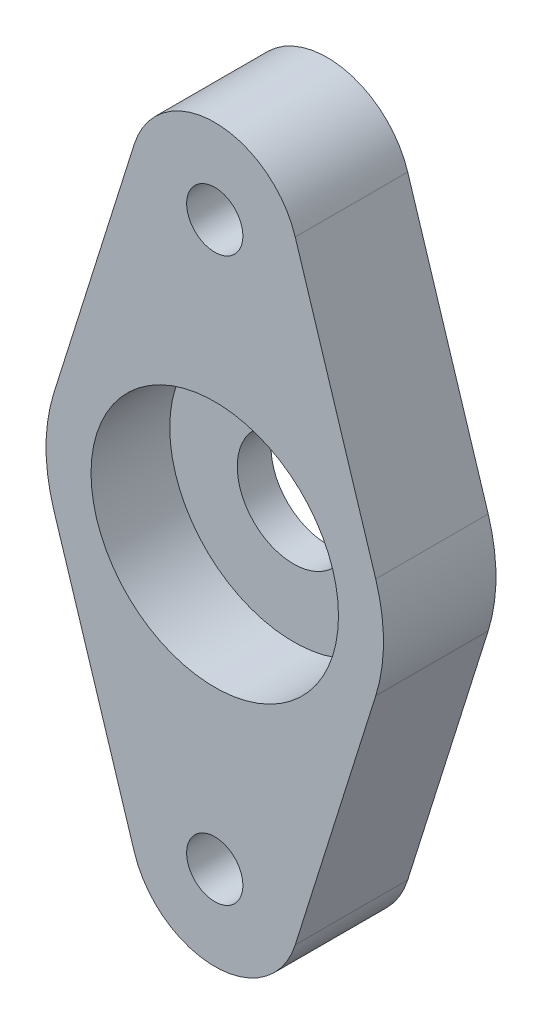
ISO-10303-21;
HEADER;
FILE_DESCRIPTION(('STEP AP214'),'2;1');
FILE_NAME('part.step','',(''),(''),'','','');
FILE_SCHEMA(('AUTOMOTIVE_DESIGN { 1 0 10303 214 1 1 1 1 }'));
ENDSEC;
DATA;
#1=APPLICATION_CONTEXT('core data for automotive mechanical design processes');
#2=APPLICATION_PROTOCOL_DEFINITION('international standard','automotive_design',2000,#1);
#3=PRODUCT_CONTEXT('',#1,'mechanical');
#4=PRODUCT('Part','Part','',(#3));
#5=PRODUCT_RELATED_PRODUCT_CATEGORY('part','',(#4));
#6=PRODUCT_DEFINITION_FORMATION('','',#4);
#7=PRODUCT_DEFINITION_CONTEXT('part definition',#1,'design');
#8=PRODUCT_DEFINITION('design','',#6,#7);
#9=PRODUCT_DEFINITION_SHAPE('','',#8);
#10=(LENGTH_UNIT() NAMED_UNIT(*) SI_UNIT(.MILLI.,.METRE.));
#11=(NAMED_UNIT(*) PLANE_ANGLE_UNIT() SI_UNIT($,.RADIAN.));
#12=(NAMED_UNIT(*) SI_UNIT($,.STERADIAN.) SOLID_ANGLE_UNIT());
#13=UNCERTAINTY_MEASURE_WITH_UNIT(LENGTH_MEASURE(1.E-05),#10,'distance_accuracy_value','');
#14=(GEOMETRIC_REPRESENTATION_CONTEXT(3) GLOBAL_UNCERTAINTY_ASSIGNED_CONTEXT((#13)) GLOBAL_UNIT_ASSIGNED_CONTEXT((#10,
#11,#12)) REPRESENTATION_CONTEXT('',''));
#15=CARTESIAN_POINT('',(0.,0.,0.));
#16=DIRECTION('',(0.,0.,1.));
#17=DIRECTION('',(1.,0.,0.));
#18=AXIS2_PLACEMENT_3D('',#15,#16,#17);
#19=CARTESIAN_POINT('',(0.,0.,10.));
#20=DIRECTION('',(0.,0.,1.));
#21=DIRECTION('',(1.,0.,0.));
#22=AXIS2_PLACEMENT_3D('',#19,#20,#21);
#23=PLANE('',#22);
#24=CARTESIAN_POINT('',(0.,0.,10.));
#25=DIRECTION('',(0.,0.,1.));
#26=DIRECTION('',(1.,0.,0.));
#27=AXIS2_PLACEMENT_3D('',#24,#25,#26);
#28=CIRCLE('',#27,11.);
#29=CARTESIAN_POINT('',(11.,0.,10.));
#30=VERTEX_POINT('',#29);
#31=EDGE_CURVE('E193',#30,#30,#28,.T.);
#32=ORIENTED_EDGE('',*,*,#31,.F.);
#33=EDGE_LOOP('',(#32));
#34=FACE_BOUND('',#33,.T.);
#35=CARTESIAN_POINT('',(0.,25.,10.));
#36=DIRECTION('',(0.,0.,1.));
#37=DIRECTION('',(1.,0.,0.));
#38=AXIS2_PLACEMENT_3D('',#35,#36,#37);
#39=CIRCLE('',#38,2.5);
#40=CARTESIAN_POINT('',(2.5,25.,10.));
#41=VERTEX_POINT('',#40);
#42=EDGE_CURVE('E136',#41,#41,#39,.T.);
#43=ORIENTED_EDGE('',*,*,#42,.F.);
#44=EDGE_LOOP('',(#43));
#45=FACE_BOUND('',#44,.T.);
#46=CARTESIAN_POINT('',(0.,0.,10.));
#47=DIRECTION('',(0.,0.,1.));
#48=DIRECTION('',(1.,0.,0.));
#49=AXIS2_PLACEMENT_3D('',#46,#47,#48);
#50=CIRCLE('',#49,15.);
#51=CARTESIAN_POINT('',(-14.3090880212542,4.5,10.));
#52=VERTEX_POINT('',#51);
#53=CARTESIAN_POINT('',(-14.3090880212542,-4.5,10.));
#54=VERTEX_POINT('',#53);
#55=EDGE_CURVE('E147',#52,#54,#50,.T.);
#56=ORIENTED_EDGE('',*,*,#55,.T.);
#57=DIRECTION('',(0.3,-0.953939201416946,0.));
#58=VECTOR('',#57,1.);
#59=CARTESIAN_POINT('',(-14.3090880212542,-4.5,10.));
#60=LINE('',#59,#58);
#61=CARTESIAN_POINT('',(-7.15454401062709,-27.25,10.));
#62=VERTEX_POINT('',#61);
#63=EDGE_CURVE('E95',#54,#62,#60,.T.);
#64=ORIENTED_EDGE('',*,*,#63,.T.);
#65=CARTESIAN_POINT('',(0.,-25.,10.));
#66=DIRECTION('',(0.,0.,1.));
#67=DIRECTION('',(1.,0.,0.));
#68=AXIS2_PLACEMENT_3D('',#65,#66,#67);
#69=CIRCLE('',#68,7.5);
#70=CARTESIAN_POINT('',(7.1545440106271,-27.25,10.));
#71=VERTEX_POINT('',#70);
#72=EDGE_CURVE('E162',#62,#71,#69,.T.);
#73=ORIENTED_EDGE('',*,*,#72,.T.);
#74=DIRECTION('',(0.3,0.953939201416946,0.));
#75=VECTOR('',#74,1.);
#76=CARTESIAN_POINT('',(14.3090880212542,-4.5,10.));
#77=LINE('',#76,#75);
#78=CARTESIAN_POINT('',(14.3090880212542,-4.50000000000001,10.));
#79=VERTEX_POINT('',#78);
#80=EDGE_CURVE('E175',#71,#79,#77,.T.);
#81=ORIENTED_EDGE('',*,*,#80,.T.);
#82=CARTESIAN_POINT('',(0.,0.,10.));
#83=DIRECTION('',(0.,0.,1.));
#84=DIRECTION('',(1.,0.,0.));
#85=AXIS2_PLACEMENT_3D('',#82,#83,#84);
#86=CIRCLE('',#85,15.);
#87=CARTESIAN_POINT('',(14.3090880212542,4.5,10.));
#88=VERTEX_POINT('',#87);
#89=EDGE_CURVE('E114',#79,#88,#86,.T.);
#90=ORIENTED_EDGE('',*,*,#89,.T.);
#91=DIRECTION('',(-0.3,0.953939201416946,0.));
#92=VECTOR('',#91,1.);
#93=CARTESIAN_POINT('',(7.1545440106271,27.25,10.));
#94=LINE('',#93,#92);
#95=CARTESIAN_POINT('',(7.1545440106271,27.25,10.));
#96=VERTEX_POINT('',#95);
#97=EDGE_CURVE('E108',#88,#96,#94,.T.);
#98=ORIENTED_EDGE('',*,*,#97,.T.);
#99=CARTESIAN_POINT('',(0.,25.,10.));
#100=DIRECTION('',(0.,0.,1.));
#101=DIRECTION('',(1.,0.,0.));
#102=AXIS2_PLACEMENT_3D('',#99,#100,#101);
#103=CIRCLE('',#102,7.5);
#104=CARTESIAN_POINT('',(-7.15454401062709,27.25,10.));
#105=VERTEX_POINT('',#104);
#106=EDGE_CURVE('E112',#96,#105,#103,.T.);
#107=ORIENTED_EDGE('',*,*,#106,.T.);
#108=DIRECTION('',(-0.3,-0.953939201416946,0.));
#109=VECTOR('',#108,1.);
#110=CARTESIAN_POINT('',(-14.3090880212542,4.5,10.));
#111=LINE('',#110,#109);
#112=EDGE_CURVE('E52',#105,#52,#111,.T.);
#113=ORIENTED_EDGE('',*,*,#112,.T.);
#114=EDGE_LOOP('',(#56,#64,#73,#81,#90,#98,#107,#113));
#115=FACE_BOUND('',#114,.T.);
#116=CARTESIAN_POINT('',(0.,-25.,10.));
#117=DIRECTION('',(0.,0.,1.));
#118=DIRECTION('',(1.,0.,0.));
#119=AXIS2_PLACEMENT_3D('',#116,#117,#118);
#120=CIRCLE('',#119,2.5);
#121=CARTESIAN_POINT('',(2.5,-25.,10.));
#122=VERTEX_POINT('',#121);
#123=EDGE_CURVE('E184',#122,#122,#120,.T.);
#124=ORIENTED_EDGE('',*,*,#123,.F.);
#125=EDGE_LOOP('',(#124));
#126=FACE_BOUND('',#125,.T.);
#127=ADVANCED_FACE('F35',(#34,#45,#115,#126),#23,.T.);
#128=CARTESIAN_POINT('',(0.,0.,0.));
#129=DIRECTION('',(0.,0.,1.));
#130=DIRECTION('',(1.,0.,0.));
#131=AXIS2_PLACEMENT_3D('',#128,#129,#130);
#132=PLANE('',#131);
#133=CARTESIAN_POINT('',(0.,0.,0.));
#134=DIRECTION('',(0.,0.,1.));
#135=DIRECTION('',(1.,0.,0.));
#136=AXIS2_PLACEMENT_3D('',#133,#134,#135);
#137=CIRCLE('',#136,5.);
#138=CARTESIAN_POINT('',(5.,0.,0.));
#139=VERTEX_POINT('',#138);
#140=EDGE_CURVE('E196',#139,#139,#137,.F.);
#141=ORIENTED_EDGE('',*,*,#140,.F.);
#142=EDGE_LOOP('',(#141));
#143=FACE_BOUND('',#142,.T.);
#144=CARTESIAN_POINT('',(0.,0.,0.));
#145=DIRECTION('',(0.,0.,1.));
#146=DIRECTION('',(1.,0.,0.));
#147=AXIS2_PLACEMENT_3D('',#144,#145,#146);
#148=CIRCLE('',#147,15.);
#149=CARTESIAN_POINT('',(-14.3090880212542,4.5,0.));
#150=VERTEX_POINT('',#149);
#151=CARTESIAN_POINT('',(-14.3090880212542,-4.5,0.));
#152=VERTEX_POINT('',#151);
#153=EDGE_CURVE('E132',#150,#152,#148,.T.);
#154=ORIENTED_EDGE('',*,*,#153,.F.);
#155=DIRECTION('',(-0.3,-0.953939201416946,0.));
#156=VECTOR('',#155,1.);
#157=CARTESIAN_POINT('',(-14.3090880212542,4.5,0.));
#158=LINE('',#157,#156);
#159=CARTESIAN_POINT('',(-7.15454401062709,27.25,0.));
#160=VERTEX_POINT('',#159);
#161=EDGE_CURVE('E87',#160,#150,#158,.T.);
#162=ORIENTED_EDGE('',*,*,#161,.F.);
#163=CARTESIAN_POINT('',(0.,25.,0.));
#164=DIRECTION('',(0.,0.,1.));
#165=DIRECTION('',(1.,0.,0.));
#166=AXIS2_PLACEMENT_3D('',#163,#164,#165);
#167=CIRCLE('',#166,7.5);
#168=CARTESIAN_POINT('',(7.1545440106271,27.25,0.));
#169=VERTEX_POINT('',#168);
#170=EDGE_CURVE('E81',#169,#160,#167,.T.);
#171=ORIENTED_EDGE('',*,*,#170,.F.);
#172=DIRECTION('',(-0.3,0.953939201416946,0.));
#173=VECTOR('',#172,1.);
#174=CARTESIAN_POINT('',(7.1545440106271,27.25,0.));
#175=LINE('',#174,#173);
#176=CARTESIAN_POINT('',(14.3090880212542,4.5,0.));
#177=VERTEX_POINT('',#176);
#178=EDGE_CURVE('E122',#177,#169,#175,.T.);
#179=ORIENTED_EDGE('',*,*,#178,.F.);
#180=CARTESIAN_POINT('',(0.,0.,0.));
#181=DIRECTION('',(0.,0.,1.));
#182=DIRECTION('',(1.,0.,0.));
#183=AXIS2_PLACEMENT_3D('',#180,#181,#182);
#184=CIRCLE('',#183,15.);
#185=CARTESIAN_POINT('',(14.3090880212542,-4.50000000000001,0.));
#186=VERTEX_POINT('',#185);
#187=EDGE_CURVE('E142',#186,#177,#184,.T.);
#188=ORIENTED_EDGE('',*,*,#187,.F.);
#189=DIRECTION('',(0.3,0.953939201416946,0.));
#190=VECTOR('',#189,1.);
#191=CARTESIAN_POINT('',(14.3090880212542,-4.5,0.));
#192=LINE('',#191,#190);
#193=CARTESIAN_POINT('',(7.1545440106271,-27.25,0.));
#194=VERTEX_POINT('',#193);
#195=EDGE_CURVE('E140',#194,#186,#192,.T.);
#196=ORIENTED_EDGE('',*,*,#195,.F.);
#197=CARTESIAN_POINT('',(0.,-25.,0.));
#198=DIRECTION('',(0.,0.,1.));
#199=DIRECTION('',(1.,0.,0.));
#200=AXIS2_PLACEMENT_3D('',#197,#198,#199);
#201=CIRCLE('',#200,7.5);
#202=CARTESIAN_POINT('',(-7.15454401062709,-27.25,0.));
#203=VERTEX_POINT('',#202);
#204=EDGE_CURVE('E138',#203,#194,#201,.T.);
#205=ORIENTED_EDGE('',*,*,#204,.F.);
#206=DIRECTION('',(0.3,-0.953939201416946,0.));
#207=VECTOR('',#206,1.);
#208=CARTESIAN_POINT('',(-14.3090880212542,-4.5,0.));
#209=LINE('',#208,#207);
#210=EDGE_CURVE('E135',#152,#203,#209,.T.);
#211=ORIENTED_EDGE('',*,*,#210,.F.);
#212=EDGE_LOOP('',(#154,#162,#171,#179,#188,#196,#205,#211));
#213=FACE_BOUND('',#212,.T.);
#214=CARTESIAN_POINT('',(0.,25.,0.));
#215=DIRECTION('',(0.,0.,1.));
#216=DIRECTION('',(1.,0.,0.));
#217=AXIS2_PLACEMENT_3D('',#214,#215,#216);
#218=CIRCLE('',#217,2.5);
#219=CARTESIAN_POINT('',(2.5,25.,0.));
#220=VERTEX_POINT('',#219);
#221=EDGE_CURVE('E181',#220,#220,#218,.T.);
#222=ORIENTED_EDGE('',*,*,#221,.T.);
#223=EDGE_LOOP('',(#222));
#224=FACE_BOUND('',#223,.T.);
#225=CARTESIAN_POINT('',(0.,-25.,0.));
#226=DIRECTION('',(0.,0.,1.));
#227=DIRECTION('',(1.,0.,0.));
#228=AXIS2_PLACEMENT_3D('',#225,#226,#227);
#229=CIRCLE('',#228,2.5);
#230=CARTESIAN_POINT('',(2.5,-25.,0.));
#231=VERTEX_POINT('',#230);
#232=EDGE_CURVE('E187',#231,#231,#229,.T.);
#233=ORIENTED_EDGE('',*,*,#232,.T.);
#234=EDGE_LOOP('',(#233));
#235=FACE_BOUND('',#234,.T.);
#236=ADVANCED_FACE('F166',(#143,#213,#224,#235),#132,.F.);
#237=CARTESIAN_POINT('',(0.,0.,10.));
#238=DIRECTION('',(0.,0.,-1.));
#239=DIRECTION('',(-1.,0.,0.));
#240=AXIS2_PLACEMENT_3D('',#237,#238,#239);
#241=CYLINDRICAL_SURFACE('',#240,15.);
#242=ORIENTED_EDGE('',*,*,#153,.T.);
#243=DIRECTION('',(0.,0.,-1.));
#244=VECTOR('',#243,1.);
#245=CARTESIAN_POINT('',(-14.3090880212542,-4.5,10.));
#246=LINE('',#245,#244);
#247=EDGE_CURVE('E11',#54,#152,#246,.T.);
#248=ORIENTED_EDGE('',*,*,#247,.F.);
#249=ORIENTED_EDGE('',*,*,#55,.F.);
#250=DIRECTION('',(0.,0.,-1.));
#251=VECTOR('',#250,1.);
#252=CARTESIAN_POINT('',(-14.3090880212542,4.5,10.));
#253=LINE('',#252,#251);
#254=EDGE_CURVE('E128',#52,#150,#253,.T.);
#255=ORIENTED_EDGE('',*,*,#254,.T.);
#256=EDGE_LOOP('',(#242,#248,#249,#255));
#257=FACE_BOUND('',#256,.T.);
#258=ADVANCED_FACE('F37',(#257),#241,.T.);
#259=CARTESIAN_POINT('',(-14.3090880212542,-4.5,10.));
#260=DIRECTION('',(0.953939201416946,0.3,0.));
#261=DIRECTION('',(-0.3,0.953939201416946,0.));
#262=AXIS2_PLACEMENT_3D('',#259,#260,#261);
#263=PLANE('',#262);
#264=ORIENTED_EDGE('',*,*,#210,.T.);
#265=DIRECTION('',(0.,0.,-1.));
#266=VECTOR('',#265,1.);
#267=CARTESIAN_POINT('',(-7.15454401062709,-27.25,10.));
#268=LINE('',#267,#266);
#269=EDGE_CURVE('E44',#62,#203,#268,.T.);
#270=ORIENTED_EDGE('',*,*,#269,.F.);
#271=ORIENTED_EDGE('',*,*,#63,.F.);
#272=ORIENTED_EDGE('',*,*,#247,.T.);
#273=EDGE_LOOP('',(#264,#270,#271,#272));
#274=FACE_BOUND('',#273,.T.);
#275=ADVANCED_FACE('F255',(#274),#263,.F.);
#276=CARTESIAN_POINT('',(0.,-25.,10.));
#277=DIRECTION('',(0.,0.,-1.));
#278=DIRECTION('',(-1.,0.,0.));
#279=AXIS2_PLACEMENT_3D('',#276,#277,#278);
#280=CYLINDRICAL_SURFACE('',#279,7.5);
#281=ORIENTED_EDGE('',*,*,#204,.T.);
#282=DIRECTION('',(0.,0.,-1.));
#283=VECTOR('',#282,1.);
#284=CARTESIAN_POINT('',(7.1545440106271,-27.25,10.));
#285=LINE('',#284,#283);
#286=EDGE_CURVE('E154',#71,#194,#285,.T.);
#287=ORIENTED_EDGE('',*,*,#286,.F.);
#288=ORIENTED_EDGE('',*,*,#72,.F.);
#289=ORIENTED_EDGE('',*,*,#269,.T.);
#290=EDGE_LOOP('',(#281,#287,#288,#289));
#291=FACE_BOUND('',#290,.T.);
#292=ADVANCED_FACE('F160',(#291),#280,.T.);
#293=CARTESIAN_POINT('',(14.3090880212542,-4.5,10.));
#294=DIRECTION('',(-0.953939201416946,0.3,0.));
#295=DIRECTION('',(-0.3,-0.953939201416946,0.));
#296=AXIS2_PLACEMENT_3D('',#293,#294,#295);
#297=PLANE('',#296);
#298=ORIENTED_EDGE('',*,*,#195,.T.);
#299=DIRECTION('',(0.,0.,-1.));
#300=VECTOR('',#299,1.);
#301=CARTESIAN_POINT('',(14.3090880212542,-4.50000000000001,10.));
#302=LINE('',#301,#300);
#303=EDGE_CURVE('E151',#79,#186,#302,.T.);
#304=ORIENTED_EDGE('',*,*,#303,.F.);
#305=ORIENTED_EDGE('',*,*,#80,.F.);
#306=ORIENTED_EDGE('',*,*,#286,.T.);
#307=EDGE_LOOP('',(#298,#304,#305,#306));
#308=FACE_BOUND('',#307,.T.);
#309=ADVANCED_FACE('F171',(#308),#297,.F.);
#310=CARTESIAN_POINT('',(0.,0.,10.));
#311=DIRECTION('',(0.,0.,-1.));
#312=DIRECTION('',(-1.,0.,0.));
#313=AXIS2_PLACEMENT_3D('',#310,#311,#312);
#314=CYLINDRICAL_SURFACE('',#313,15.);
#315=ORIENTED_EDGE('',*,*,#187,.T.);
#316=DIRECTION('',(0.,0.,-1.));
#317=VECTOR('',#316,1.);
#318=CARTESIAN_POINT('',(14.3090880212542,4.5,10.));
#319=LINE('',#318,#317);
#320=EDGE_CURVE('E123',#88,#177,#319,.T.);
#321=ORIENTED_EDGE('',*,*,#320,.F.);
#322=ORIENTED_EDGE('',*,*,#89,.F.);
#323=ORIENTED_EDGE('',*,*,#303,.T.);
#324=EDGE_LOOP('',(#315,#321,#322,#323));
#325=FACE_BOUND('',#324,.T.);
#326=ADVANCED_FACE('F174',(#325),#314,.T.);
#327=CARTESIAN_POINT('',(7.1545440106271,27.25,10.));
#328=DIRECTION('',(-0.953939201416946,-0.3,0.));
#329=DIRECTION('',(0.3,-0.953939201416946,0.));
#330=AXIS2_PLACEMENT_3D('',#327,#328,#329);
#331=PLANE('',#330);
#332=ORIENTED_EDGE('',*,*,#178,.T.);
#333=DIRECTION('',(0.,0.,-1.));
#334=VECTOR('',#333,1.);
#335=CARTESIAN_POINT('',(7.1545440106271,27.25,10.));
#336=LINE('',#335,#334);
#337=EDGE_CURVE('E119',#96,#169,#336,.T.);
#338=ORIENTED_EDGE('',*,*,#337,.F.);
#339=ORIENTED_EDGE('',*,*,#97,.F.);
#340=ORIENTED_EDGE('',*,*,#320,.T.);
#341=EDGE_LOOP('',(#332,#338,#339,#340));
#342=FACE_BOUND('',#341,.T.);
#343=ADVANCED_FACE('F120',(#342),#331,.F.);
#344=CARTESIAN_POINT('',(0.,25.,10.));
#345=DIRECTION('',(0.,0.,-1.));
#346=DIRECTION('',(-1.,0.,0.));
#347=AXIS2_PLACEMENT_3D('',#344,#345,#346);
#348=CYLINDRICAL_SURFACE('',#347,7.5);
#349=ORIENTED_EDGE('',*,*,#170,.T.);
#350=DIRECTION('',(0.,0.,-1.));
#351=VECTOR('',#350,1.);
#352=CARTESIAN_POINT('',(-7.15454401062709,27.25,10.));
#353=LINE('',#352,#351);
#354=EDGE_CURVE('E124',#105,#160,#353,.T.);
#355=ORIENTED_EDGE('',*,*,#354,.F.);
#356=ORIENTED_EDGE('',*,*,#106,.F.);
#357=ORIENTED_EDGE('',*,*,#337,.T.);
#358=EDGE_LOOP('',(#349,#355,#356,#357));
#359=FACE_BOUND('',#358,.T.);
#360=ADVANCED_FACE('F126',(#359),#348,.T.);
#361=CARTESIAN_POINT('',(-14.3090880212542,4.5,10.));
#362=DIRECTION('',(0.953939201416946,-0.3,0.));
#363=DIRECTION('',(0.3,0.953939201416946,0.));
#364=AXIS2_PLACEMENT_3D('',#361,#362,#363);
#365=PLANE('',#364);
#366=ORIENTED_EDGE('',*,*,#161,.T.);
#367=ORIENTED_EDGE('',*,*,#254,.F.);
#368=ORIENTED_EDGE('',*,*,#112,.F.);
#369=ORIENTED_EDGE('',*,*,#354,.T.);
#370=EDGE_LOOP('',(#366,#367,#368,#369));
#371=FACE_BOUND('',#370,.T.);
#372=ADVANCED_FACE('F229',(#371),#365,.F.);
#373=CARTESIAN_POINT('',(0.,25.,10.));
#374=DIRECTION('',(0.,0.,-1.));
#375=DIRECTION('',(-1.,0.,0.));
#376=AXIS2_PLACEMENT_3D('',#373,#374,#375);
#377=CYLINDRICAL_SURFACE('',#376,2.5);
#378=ORIENTED_EDGE('',*,*,#42,.T.);
#379=EDGE_LOOP('',(#378));
#380=FACE_BOUND('',#379,.T.);
#381=ORIENTED_EDGE('',*,*,#221,.F.);
#382=EDGE_LOOP('',(#381));
#383=FACE_BOUND('',#382,.T.);
#384=ADVANCED_FACE('F226',(#380,#383),#377,.F.);
#385=CARTESIAN_POINT('',(0.,-25.,10.));
#386=DIRECTION('',(0.,0.,-1.));
#387=DIRECTION('',(-1.,0.,0.));
#388=AXIS2_PLACEMENT_3D('',#385,#386,#387);
#389=CYLINDRICAL_SURFACE('',#388,2.5);
#390=ORIENTED_EDGE('',*,*,#123,.T.);
#391=EDGE_LOOP('',(#390));
#392=FACE_BOUND('',#391,.T.);
#393=ORIENTED_EDGE('',*,*,#232,.F.);
#394=EDGE_LOOP('',(#393));
#395=FACE_BOUND('',#394,.T.);
#396=ADVANCED_FACE('F217',(#392,#395),#389,.F.);
#397=CARTESIAN_POINT('',(0.,0.,3.));
#398=DIRECTION('',(0.,0.,1.));
#399=DIRECTION('',(1.,0.,0.));
#400=AXIS2_PLACEMENT_3D('',#397,#398,#399);
#401=CYLINDRICAL_SURFACE('',#400,11.);
#402=CARTESIAN_POINT('',(0.,0.,3.));
#403=DIRECTION('',(0.,0.,1.));
#404=DIRECTION('',(1.,0.,0.));
#405=AXIS2_PLACEMENT_3D('',#402,#403,#404);
#406=CIRCLE('',#405,11.);
#407=CARTESIAN_POINT('',(11.,0.,3.));
#408=VERTEX_POINT('',#407);
#409=EDGE_CURVE('E190',#408,#408,#406,.T.);
#410=ORIENTED_EDGE('',*,*,#409,.F.);
#411=EDGE_LOOP('',(#410));
#412=FACE_BOUND('',#411,.T.);
#413=ORIENTED_EDGE('',*,*,#31,.T.);
#414=EDGE_LOOP('',(#413));
#415=FACE_BOUND('',#414,.T.);
#416=ADVANCED_FACE('F211',(#412,#415),#401,.F.);
#417=CARTESIAN_POINT('',(0.,0.,3.));
#418=DIRECTION('',(0.,0.,1.));
#419=DIRECTION('',(1.,0.,0.));
#420=AXIS2_PLACEMENT_3D('',#417,#418,#419);
#421=PLANE('',#420);
#422=CARTESIAN_POINT('',(0.,0.,3.));
#423=DIRECTION('',(0.,0.,1.));
#424=DIRECTION('',(1.,0.,0.));
#425=AXIS2_PLACEMENT_3D('',#422,#423,#424);
#426=CIRCLE('',#425,5.);
#427=CARTESIAN_POINT('',(5.,0.,3.));
#428=VERTEX_POINT('',#427);
#429=EDGE_CURVE('E201',#428,#428,#426,.T.);
#430=ORIENTED_EDGE('',*,*,#429,.F.);
#431=EDGE_LOOP('',(#430));
#432=FACE_BOUND('',#431,.T.);
#433=ORIENTED_EDGE('',*,*,#409,.T.);
#434=EDGE_LOOP('',(#433));
#435=FACE_BOUND('',#434,.T.);
#436=ADVANCED_FACE('F208',(#432,#435),#421,.T.);
#437=CARTESIAN_POINT('',(0.,0.,-0.00100000000000013));
#438=DIRECTION('',(0.,0.,1.));
#439=DIRECTION('',(1.,0.,0.));
#440=AXIS2_PLACEMENT_3D('',#437,#438,#439);
#441=CYLINDRICAL_SURFACE('',#440,5.);
#442=ORIENTED_EDGE('',*,*,#429,.T.);
#443=EDGE_LOOP('',(#442));
#444=FACE_BOUND('',#443,.T.);
#445=ORIENTED_EDGE('',*,*,#140,.T.);
#446=EDGE_LOOP('',(#445));
#447=FACE_BOUND('',#446,.T.);
#448=ADVANCED_FACE('F205',(#444,#447),#441,.F.);
#449=CLOSED_SHELL('',(#127,#236,#258,#275,#292,#309,#326,#343,#360,#372,#384,#396,#416,#436,#448));
#450=MANIFOLD_SOLID_BREP('B2',#449);
#451=ADVANCED_BREP_SHAPE_REPRESENTATION('',(#18,#450),#14);
#452=SHAPE_DEFINITION_REPRESENTATION(#9,#451);
ENDSEC;
END-ISO-10303-21;
